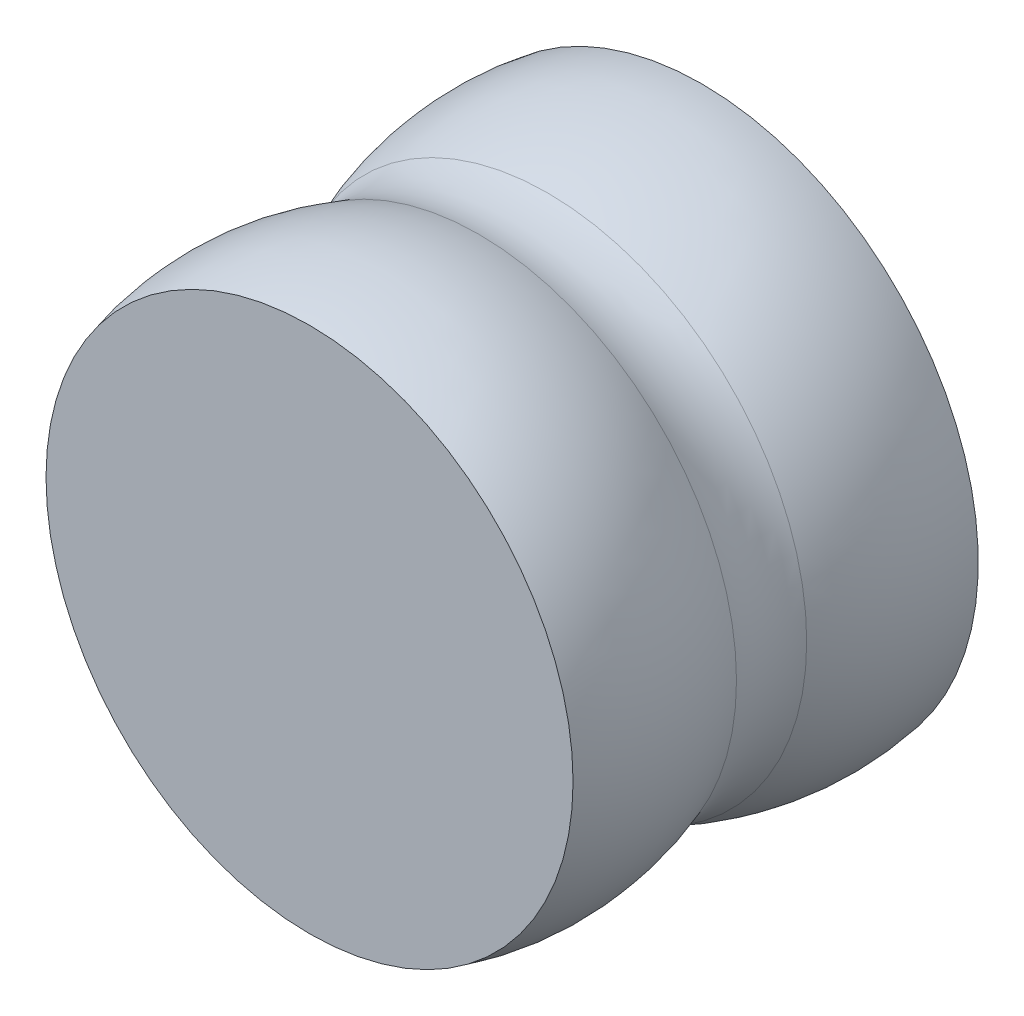
ISO-10303-21;
HEADER;
FILE_DESCRIPTION(('STEP AP214'),'2;1');
FILE_NAME('part.step','',(''),(''),'','','');
FILE_SCHEMA(('AUTOMOTIVE_DESIGN { 1 0 10303 214 1 1 1 1 }'));
ENDSEC;
DATA;
#1=APPLICATION_CONTEXT('core data for automotive mechanical design processes');
#2=APPLICATION_PROTOCOL_DEFINITION('international standard','automotive_design',2000,#1);
#3=PRODUCT_CONTEXT('',#1,'mechanical');
#4=PRODUCT('Part','Part','',(#3));
#5=PRODUCT_RELATED_PRODUCT_CATEGORY('part','',(#4));
#6=PRODUCT_DEFINITION_FORMATION('','',#4);
#7=PRODUCT_DEFINITION_CONTEXT('part definition',#1,'design');
#8=PRODUCT_DEFINITION('design','',#6,#7);
#9=PRODUCT_DEFINITION_SHAPE('','',#8);
#10=(LENGTH_UNIT() NAMED_UNIT(*) SI_UNIT(.MILLI.,.METRE.));
#11=(NAMED_UNIT(*) PLANE_ANGLE_UNIT() SI_UNIT($,.RADIAN.));
#12=(NAMED_UNIT(*) SI_UNIT($,.STERADIAN.) SOLID_ANGLE_UNIT());
#13=UNCERTAINTY_MEASURE_WITH_UNIT(LENGTH_MEASURE(1.E-05),#10,'distance_accuracy_value','');
#14=(GEOMETRIC_REPRESENTATION_CONTEXT(3) GLOBAL_UNCERTAINTY_ASSIGNED_CONTEXT((#13)) GLOBAL_UNIT_ASSIGNED_CONTEXT((#10,
#11,#12)) REPRESENTATION_CONTEXT('',''));
#15=CARTESIAN_POINT('',(0.,0.,0.));
#16=DIRECTION('',(0.,0.,1.));
#17=DIRECTION('',(1.,0.,0.));
#18=AXIS2_PLACEMENT_3D('',#15,#16,#17);
#19=CARTESIAN_POINT('',(0.,0.,-1.68467858311788E-13));
#20=DIRECTION('',(0.,0.,1.));
#21=DIRECTION('',(0.,-1.,0.));
#22=AXIS2_PLACEMENT_3D('',#19,#20,#21);
#23=PLANE('',#22);
#24=CARTESIAN_POINT('',(0.,0.,-3.36935716623576E-13));
#25=DIRECTION('',(0.,0.,-1.));
#26=DIRECTION('',(0.,1.,0.));
#27=AXIS2_PLACEMENT_3D('',#24,#25,#26);
#28=CIRCLE('',#27,35.8771877706717);
#29=CARTESIAN_POINT('',(0.,35.8771877706717,-3.32542028307E-13));
#30=VERTEX_POINT('',#29);
#31=EDGE_CURVE('E10',#30,#30,#28,.T.);
#32=ORIENTED_EDGE('',*,*,#31,.T.);
#33=EDGE_LOOP('',(#32));
#34=FACE_BOUND('',#33,.T.);
#35=ADVANCED_FACE('F37',(#34),#23,.F.);
#36=CARTESIAN_POINT('',(0.,0.,6.14714548940946));
#37=DIRECTION('',(0.,0.,-1.));
#38=DIRECTION('',(0.,1.,0.));
#39=AXIS2_PLACEMENT_3D('',#36,#37,#38);
#40=SPHERICAL_SURFACE('',#39,36.4);
#41=ORIENTED_EDGE('',*,*,#31,.F.);
#42=EDGE_LOOP('',(#41));
#43=FACE_BOUND('',#42,.T.);
#44=CARTESIAN_POINT('',(0.,0.,20.0426639516433));
#45=DIRECTION('',(0.,0.,-1.));
#46=DIRECTION('',(0.,1.,0.));
#47=AXIS2_PLACEMENT_3D('',#44,#45,#46);
#48=CIRCLE('',#47,33.6433435714365);
#49=CARTESIAN_POINT('',(0.,33.6433435714365,20.0426639516433));
#50=VERTEX_POINT('',#49);
#51=EDGE_CURVE('E43',#50,#50,#48,.T.);
#52=ORIENTED_EDGE('',*,*,#51,.T.);
#53=EDGE_LOOP('',(#52));
#54=FACE_BOUND('',#53,.T.);
#55=ADVANCED_FACE('F69',(#43,#54),#40,.T.);
#56=CARTESIAN_POINT('',(0.,0.,24.75197458285));
#57=DIRECTION('',(0.,0.,-1.));
#58=DIRECTION('',(0.,1.,0.));
#59=AXIS2_PLACEMENT_3D('',#56,#57,#58);
#60=TOROIDAL_SURFACE('',#59,45.0453618538717,12.3362728380246);
#61=ORIENTED_EDGE('',*,*,#51,.F.);
#62=EDGE_LOOP('',(#61));
#63=FACE_BOUND('',#62,.T.);
#64=CARTESIAN_POINT('',(0.,0.,28.9712283870158));
#65=DIRECTION('',(0.,0.,-1.));
#66=DIRECTION('',(0.,1.,0.));
#67=AXIS2_PLACEMENT_3D('',#64,#65,#66);
#68=CIRCLE('',#67,33.4530572999784);
#69=CARTESIAN_POINT('',(0.,33.4530572999784,28.9712283870158));
#70=VERTEX_POINT('',#69);
#71=EDGE_CURVE('E47',#70,#70,#68,.T.);
#72=ORIENTED_EDGE('',*,*,#71,.T.);
#73=EDGE_LOOP('',(#72));
#74=FACE_BOUND('',#73,.T.);
#75=ADVANCED_FACE('F66',(#63,#74),#60,.F.);
#76=CARTESIAN_POINT('',(0.,0.,41.1471454894095));
#77=DIRECTION('',(0.,0.,-1.));
#78=DIRECTION('',(0.,1.,0.));
#79=AXIS2_PLACEMENT_3D('',#76,#77,#78);
#80=SPHERICAL_SURFACE('',#79,35.6);
#81=CARTESIAN_POINT('',(0.,0.,50.9598353564945));
#82=DIRECTION('',(0.,0.,-1.));
#83=DIRECTION('',(0.,1.,0.));
#84=AXIS2_PLACEMENT_3D('',#81,#82,#83);
#85=CIRCLE('',#84,34.2209163754042);
#86=CARTESIAN_POINT('',(0.,34.2209163754042,50.9598353564945));
#87=VERTEX_POINT('',#86);
#88=EDGE_CURVE('E51',#87,#87,#85,.T.);
#89=ORIENTED_EDGE('',*,*,#88,.T.);
#90=EDGE_LOOP('',(#89));
#91=FACE_BOUND('',#90,.T.);
#92=ORIENTED_EDGE('',*,*,#71,.F.);
#93=EDGE_LOOP('',(#92));
#94=FACE_BOUND('',#93,.T.);
#95=ADVANCED_FACE('F57',(#91,#94),#80,.T.);
#96=CARTESIAN_POINT('',(0.,-6.79004948787938E-13,50.9598353564945));
#97=DIRECTION('',(0.,0.,1.));
#98=DIRECTION('',(0.,-1.,0.));
#99=AXIS2_PLACEMENT_3D('',#96,#97,#98);
#100=PLANE('',#99);
#101=ORIENTED_EDGE('',*,*,#88,.F.);
#102=EDGE_LOOP('',(#101));
#103=FACE_BOUND('',#102,.T.);
#104=ADVANCED_FACE('F60',(#103),#100,.T.);
#105=CLOSED_SHELL('',(#35,#55,#75,#95,#104));
#106=MANIFOLD_SOLID_BREP('B2',#105);
#107=ADVANCED_BREP_SHAPE_REPRESENTATION('',(#18,#106),#14);
#108=SHAPE_DEFINITION_REPRESENTATION(#9,#107);
ENDSEC;
END-ISO-10303-21;
